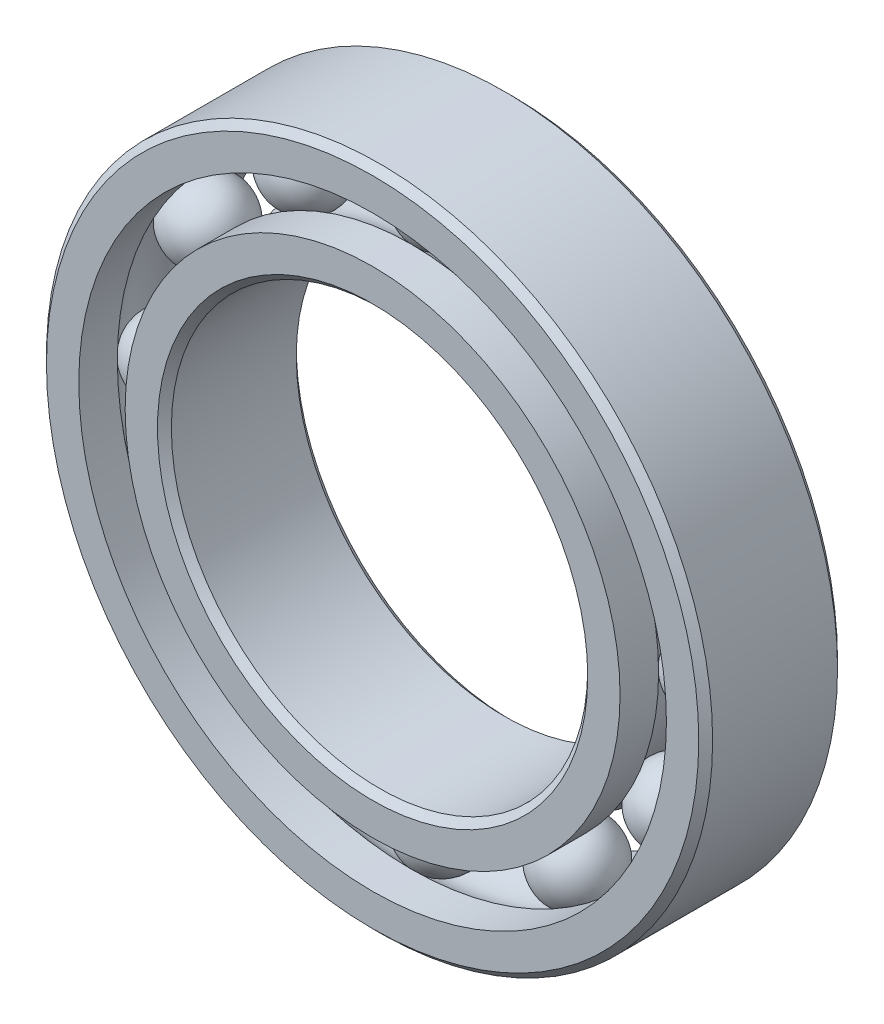
ISO-10303-21;
HEADER;
FILE_DESCRIPTION(('STEP AP214'),'2;1');
FILE_NAME('part.step','',(''),(''),'','','');
FILE_SCHEMA(('AUTOMOTIVE_DESIGN { 1 0 10303 214 1 1 1 1 }'));
ENDSEC;
DATA;
#1=APPLICATION_CONTEXT('core data for automotive mechanical design processes');
#2=APPLICATION_PROTOCOL_DEFINITION('international standard','automotive_design',2000,#1);
#3=PRODUCT_CONTEXT('',#1,'mechanical');
#4=PRODUCT('Part','Part','',(#3));
#5=PRODUCT_RELATED_PRODUCT_CATEGORY('part','',(#4));
#6=PRODUCT_DEFINITION_FORMATION('','',#4);
#7=PRODUCT_DEFINITION_CONTEXT('part definition',#1,'design');
#8=PRODUCT_DEFINITION('design','',#6,#7);
#9=PRODUCT_DEFINITION_SHAPE('','',#8);
#10=(LENGTH_UNIT() NAMED_UNIT(*) SI_UNIT(.MILLI.,.METRE.));
#11=(NAMED_UNIT(*) PLANE_ANGLE_UNIT() SI_UNIT($,.RADIAN.));
#12=(NAMED_UNIT(*) SI_UNIT($,.STERADIAN.) SOLID_ANGLE_UNIT());
#13=UNCERTAINTY_MEASURE_WITH_UNIT(LENGTH_MEASURE(1.E-05),#10,'distance_accuracy_value','');
#14=(GEOMETRIC_REPRESENTATION_CONTEXT(3) GLOBAL_UNCERTAINTY_ASSIGNED_CONTEXT((#13)) GLOBAL_UNIT_ASSIGNED_CONTEXT((#10,
#11,#12)) REPRESENTATION_CONTEXT('',''));
#15=CARTESIAN_POINT('',(0.,0.,0.));
#16=DIRECTION('',(0.,0.,1.));
#17=DIRECTION('',(1.,0.,0.));
#18=AXIS2_PLACEMENT_3D('',#15,#16,#17);
#19=CARTESIAN_POINT('',(-4.87499999999989,8.44374768689834,0.));
#20=DIRECTION('',(0.,0.,1.));
#21=DIRECTION('',(-0.499999999999989,0.866025403784445,0.));
#22=AXIS2_PLACEMENT_3D('',#19,#20,#21);
#23=SPHERICAL_SURFACE('',#22,1.38998856223009);
#24=CARTESIAN_POINT('',(-4.87499999999989,8.44374768689834,1.38998856223009));
#25=VERTEX_POINT('',#24);
#26=VERTEX_LOOP('',#25);
#27=FACE_BOUND('',#26,.T.);
#28=ADVANCED_FACE('F37',(#27),#23,.T.);
#29=CLOSED_SHELL('',(#28));
#30=MANIFOLD_SOLID_BREP('B2',#29);
#31=CARTESIAN_POINT('',(-8.44374768689822,4.8750000000001,0.));
#32=DIRECTION('',(0.,0.,1.));
#33=DIRECTION('',(-0.866025403784433,0.50000000000001,0.));
#34=AXIS2_PLACEMENT_3D('',#31,#32,#33);
#35=SPHERICAL_SURFACE('',#34,1.38998856223009);
#36=CARTESIAN_POINT('',(-8.44374768689822,4.8750000000001,1.38998856223009));
#37=VERTEX_POINT('',#36);
#38=VERTEX_LOOP('',#37);
#39=FACE_BOUND('',#38,.T.);
#40=ADVANCED_FACE('F57',(#39),#35,.T.);
#41=CLOSED_SHELL('',(#40));
#42=MANIFOLD_SOLID_BREP('B6',#41);
#43=CARTESIAN_POINT('',(-9.75,1.02125829161162E-13,0.));
#44=DIRECTION('',(0.,0.,1.));
#45=DIRECTION('',(-1.,0.,0.));
#46=AXIS2_PLACEMENT_3D('',#43,#44,#45);
#47=SPHERICAL_SURFACE('',#46,1.38998856223009);
#48=CARTESIAN_POINT('',(-9.75,1.02125829161162E-13,1.38998856223009));
#49=VERTEX_POINT('',#48);
#50=VERTEX_LOOP('',#49);
#51=FACE_BOUND('',#50,.T.);
#52=ADVANCED_FACE('F77',(#51),#47,.T.);
#53=CLOSED_SHELL('',(#52));
#54=MANIFOLD_SOLID_BREP('B33',#53);
#55=CARTESIAN_POINT('',(-8.44374768689832,-4.87499999999992,0.));
#56=DIRECTION('',(0.,0.,1.));
#57=DIRECTION('',(-0.866025403784443,-0.499999999999992,0.));
#58=AXIS2_PLACEMENT_3D('',#55,#56,#57);
#59=SPHERICAL_SURFACE('',#58,1.38998856223009);
#60=CARTESIAN_POINT('',(-8.44374768689832,-4.87499999999992,1.38998856223009));
#61=VERTEX_POINT('',#60);
#62=VERTEX_LOOP('',#61);
#63=FACE_BOUND('',#62,.T.);
#64=ADVANCED_FACE('F97',(#63),#59,.T.);
#65=CLOSED_SHELL('',(#64));
#66=MANIFOLD_SOLID_BREP('B53',#65);
#67=CARTESIAN_POINT('',(-4.87500000000007,-8.44374768689824,0.));
#68=DIRECTION('',(0.,0.,1.));
#69=DIRECTION('',(-0.500000000000007,-0.866025403784435,0.));
#70=AXIS2_PLACEMENT_3D('',#67,#68,#69);
#71=SPHERICAL_SURFACE('',#70,1.38998856223009);
#72=CARTESIAN_POINT('',(-4.87500000000007,-8.44374768689824,1.38998856223009));
#73=VERTEX_POINT('',#72);
#74=VERTEX_LOOP('',#73);
#75=FACE_BOUND('',#74,.T.);
#76=ADVANCED_FACE('F117',(#75),#71,.T.);
#77=CLOSED_SHELL('',(#76));
#78=MANIFOLD_SOLID_BREP('B73',#77);
#79=CARTESIAN_POINT('',(0.,-9.75,0.));
#80=DIRECTION('',(0.,0.,1.));
#81=DIRECTION('',(0.,-1.,0.));
#82=AXIS2_PLACEMENT_3D('',#79,#80,#81);
#83=SPHERICAL_SURFACE('',#82,1.38998856223009);
#84=CARTESIAN_POINT('',(0.,-9.75,1.38998856223009));
#85=VERTEX_POINT('',#84);
#86=VERTEX_LOOP('',#85);
#87=FACE_BOUND('',#86,.T.);
#88=ADVANCED_FACE('F137',(#87),#83,.T.);
#89=CLOSED_SHELL('',(#88));
#90=MANIFOLD_SOLID_BREP('B93',#89);
#91=CARTESIAN_POINT('',(4.87499999999995,-8.44374768689831,0.));
#92=DIRECTION('',(0.,0.,1.));
#93=DIRECTION('',(0.499999999999995,-0.866025403784442,0.));
#94=AXIS2_PLACEMENT_3D('',#91,#92,#93);
#95=SPHERICAL_SURFACE('',#94,1.38998856223009);
#96=CARTESIAN_POINT('',(4.87499999999995,-8.44374768689831,1.38998856223009));
#97=VERTEX_POINT('',#96);
#98=VERTEX_LOOP('',#97);
#99=FACE_BOUND('',#98,.T.);
#100=ADVANCED_FACE('F157',(#99),#95,.T.);
#101=CLOSED_SHELL('',(#100));
#102=MANIFOLD_SOLID_BREP('B113',#101);
#103=CARTESIAN_POINT('',(8.44374768689826,-4.87500000000004,0.));
#104=DIRECTION('',(0.,0.,1.));
#105=DIRECTION('',(0.866025403784436,-0.500000000000004,0.));
#106=AXIS2_PLACEMENT_3D('',#103,#104,#105);
#107=SPHERICAL_SURFACE('',#106,1.38998856223009);
#108=CARTESIAN_POINT('',(8.44374768689826,-4.87500000000004,1.38998856223009));
#109=VERTEX_POINT('',#108);
#110=VERTEX_LOOP('',#109);
#111=FACE_BOUND('',#110,.T.);
#112=ADVANCED_FACE('F177',(#111),#107,.T.);
#113=CLOSED_SHELL('',(#112));
#114=MANIFOLD_SOLID_BREP('B133',#113);
#115=CARTESIAN_POINT('',(9.75,0.,0.));
#116=DIRECTION('',(0.,0.,1.));
#117=DIRECTION('',(1.,0.,0.));
#118=AXIS2_PLACEMENT_3D('',#115,#116,#117);
#119=SPHERICAL_SURFACE('',#118,1.38998856223009);
#120=CARTESIAN_POINT('',(9.75,0.,1.38998856223009));
#121=VERTEX_POINT('',#120);
#122=VERTEX_LOOP('',#121);
#123=FACE_BOUND('',#122,.T.);
#124=ADVANCED_FACE('F197',(#123),#119,.T.);
#125=CLOSED_SHELL('',(#124));
#126=MANIFOLD_SOLID_BREP('B153',#125);
#127=CARTESIAN_POINT('',(8.44374768689829,4.87499999999998,0.));
#128=DIRECTION('',(0.,0.,1.));
#129=DIRECTION('',(0.86602540378444,0.499999999999998,0.));
#130=AXIS2_PLACEMENT_3D('',#127,#128,#129);
#131=SPHERICAL_SURFACE('',#130,1.38998856223009);
#132=CARTESIAN_POINT('',(8.44374768689829,4.87499999999998,1.38998856223009));
#133=VERTEX_POINT('',#132);
#134=VERTEX_LOOP('',#133);
#135=FACE_BOUND('',#134,.T.);
#136=ADVANCED_FACE('F217',(#135),#131,.T.);
#137=CLOSED_SHELL('',(#136));
#138=MANIFOLD_SOLID_BREP('B173',#137);
#139=CARTESIAN_POINT('',(4.87500000000001,8.44374768689827,0.));
#140=DIRECTION('',(0.,0.,1.));
#141=DIRECTION('',(0.500000000000001,0.866025403784438,0.));
#142=AXIS2_PLACEMENT_3D('',#139,#140,#141);
#143=SPHERICAL_SURFACE('',#142,1.38998856223009);
#144=CARTESIAN_POINT('',(4.87500000000001,8.44374768689827,1.38998856223009));
#145=VERTEX_POINT('',#144);
#146=VERTEX_LOOP('',#145);
#147=FACE_BOUND('',#146,.T.);
#148=ADVANCED_FACE('F237',(#147),#143,.T.);
#149=CLOSED_SHELL('',(#148));
#150=MANIFOLD_SOLID_BREP('B193',#149);
#151=CARTESIAN_POINT('',(0.,9.75,0.));
#152=DIRECTION('',(0.,0.,1.));
#153=DIRECTION('',(0.,1.,0.));
#154=AXIS2_PLACEMENT_3D('',#151,#152,#153);
#155=SPHERICAL_SURFACE('',#154,1.38998856223009);
#156=CARTESIAN_POINT('',(0.,9.75,1.38998856223009));
#157=VERTEX_POINT('',#156);
#158=VERTEX_LOOP('',#157);
#159=FACE_BOUND('',#158,.T.);
#160=ADVANCED_FACE('F259',(#159),#155,.T.);
#161=CLOSED_SHELL('',(#160));
#162=MANIFOLD_SOLID_BREP('B213',#161);
#163=CARTESIAN_POINT('',(0.,8.91483516483517,2.5));
#164=DIRECTION('',(0.,0.,-1.));
#165=DIRECTION('',(-1.,0.,0.));
#166=AXIS2_PLACEMENT_3D('',#163,#164,#165);
#167=PLANE('',#166);
#168=CARTESIAN_POINT('',(0.,0.,2.5));
#169=DIRECTION('',(0.,0.,1.));
#170=DIRECTION('',(1.,0.,0.));
#171=AXIS2_PLACEMENT_3D('',#168,#169,#170);
#172=CIRCLE('',#171,7.75);
#173=CARTESIAN_POINT('',(7.75,0.,2.5));
#174=VERTEX_POINT('',#173);
#175=EDGE_CURVE('E306',#174,#174,#172,.T.);
#176=ORIENTED_EDGE('',*,*,#175,.F.);
#177=EDGE_LOOP('',(#176));
#178=FACE_BOUND('',#177,.T.);
#179=CARTESIAN_POINT('',(0.,0.,2.5));
#180=DIRECTION('',(0.,0.,1.));
#181=DIRECTION('',(1.,0.,0.));
#182=AXIS2_PLACEMENT_3D('',#179,#180,#181);
#183=CIRCLE('',#182,8.91483516483517);
#184=CARTESIAN_POINT('',(8.91483516483517,0.,2.5));
#185=VERTEX_POINT('',#184);
#186=EDGE_CURVE('E258',#185,#185,#183,.T.);
#187=ORIENTED_EDGE('',*,*,#186,.T.);
#188=EDGE_LOOP('',(#187));
#189=FACE_BOUND('',#188,.T.);
#190=ADVANCED_FACE('F278',(#178,#189),#167,.F.);
#191=CARTESIAN_POINT('',(0.,0.,2.5));
#192=DIRECTION('',(0.,0.,1.));
#193=DIRECTION('',(1.,0.,0.));
#194=AXIS2_PLACEMENT_3D('',#191,#192,#193);
#195=CYLINDRICAL_SURFACE('',#194,8.91483516483517);
#196=ORIENTED_EDGE('',*,*,#186,.F.);
#197=EDGE_LOOP('',(#196));
#198=FACE_BOUND('',#197,.T.);
#199=CARTESIAN_POINT('',(0.,0.,1.11111111111111));
#200=DIRECTION('',(0.,0.,1.));
#201=DIRECTION('',(1.,0.,0.));
#202=AXIS2_PLACEMENT_3D('',#199,#200,#201);
#203=CIRCLE('',#202,8.91483516483517);
#204=CARTESIAN_POINT('',(8.91483516483517,0.,1.11111111111111));
#205=VERTEX_POINT('',#204);
#206=EDGE_CURVE('E284',#205,#205,#203,.T.);
#207=ORIENTED_EDGE('',*,*,#206,.T.);
#208=EDGE_LOOP('',(#207));
#209=FACE_BOUND('',#208,.T.);
#210=ADVANCED_FACE('F313',(#198,#209),#195,.T.);
#211=CARTESIAN_POINT('',(0.,0.,0.));
#212=DIRECTION('',(0.,0.,1.));
#213=DIRECTION('',(1.,0.,0.));
#214=AXIS2_PLACEMENT_3D('',#211,#212,#213);
#215=TOROIDAL_SURFACE('',#214,9.75,1.38998856223009);
#216=ORIENTED_EDGE('',*,*,#206,.F.);
#217=EDGE_LOOP('',(#216));
#218=FACE_BOUND('',#217,.T.);
#219=CARTESIAN_POINT('',(0.,0.,-1.11111111111111));
#220=DIRECTION('',(0.,0.,1.));
#221=DIRECTION('',(1.,0.,0.));
#222=AXIS2_PLACEMENT_3D('',#219,#220,#221);
#223=CIRCLE('',#222,8.91483516483516);
#224=CARTESIAN_POINT('',(8.91483516483516,0.,-1.11111111111111));
#225=VERTEX_POINT('',#224);
#226=EDGE_CURVE('E288',#225,#225,#223,.T.);
#227=ORIENTED_EDGE('',*,*,#226,.T.);
#228=EDGE_LOOP('',(#227));
#229=FACE_BOUND('',#228,.T.);
#230=ADVANCED_FACE('F317',(#218,#229),#215,.F.);
#231=CARTESIAN_POINT('',(0.,0.,2.5));
#232=DIRECTION('',(0.,0.,1.));
#233=DIRECTION('',(1.,0.,0.));
#234=AXIS2_PLACEMENT_3D('',#231,#232,#233);
#235=CYLINDRICAL_SURFACE('',#234,8.91483516483517);
#236=ORIENTED_EDGE('',*,*,#226,.F.);
#237=EDGE_LOOP('',(#236));
#238=FACE_BOUND('',#237,.T.);
#239=CARTESIAN_POINT('',(0.,0.,-2.5));
#240=DIRECTION('',(0.,0.,1.));
#241=DIRECTION('',(1.,0.,0.));
#242=AXIS2_PLACEMENT_3D('',#239,#240,#241);
#243=CIRCLE('',#242,8.91483516483517);
#244=CARTESIAN_POINT('',(8.91483516483517,0.,-2.5));
#245=VERTEX_POINT('',#244);
#246=EDGE_CURVE('E292',#245,#245,#243,.T.);
#247=ORIENTED_EDGE('',*,*,#246,.T.);
#248=EDGE_LOOP('',(#247));
#249=FACE_BOUND('',#248,.T.);
#250=ADVANCED_FACE('F322',(#238,#249),#235,.T.);
#251=CARTESIAN_POINT('',(0.,7.75,-2.5));
#252=DIRECTION('',(0.,0.,1.));
#253=DIRECTION('',(1.,0.,0.));
#254=AXIS2_PLACEMENT_3D('',#251,#252,#253);
#255=PLANE('',#254);
#256=ORIENTED_EDGE('',*,*,#246,.F.);
#257=EDGE_LOOP('',(#256));
#258=FACE_BOUND('',#257,.T.);
#259=CARTESIAN_POINT('',(0.,0.,-2.5));
#260=DIRECTION('',(0.,0.,1.));
#261=DIRECTION('',(1.,0.,0.));
#262=AXIS2_PLACEMENT_3D('',#259,#260,#261);
#263=CIRCLE('',#262,7.75);
#264=CARTESIAN_POINT('',(7.75,0.,-2.5));
#265=VERTEX_POINT('',#264);
#266=EDGE_CURVE('E297',#265,#265,#263,.T.);
#267=ORIENTED_EDGE('',*,*,#266,.T.);
#268=EDGE_LOOP('',(#267));
#269=FACE_BOUND('',#268,.T.);
#270=ADVANCED_FACE('F328',(#258,#269),#255,.F.);
#271=CARTESIAN_POINT('',(0.,0.,-2.25));
#272=DIRECTION('',(0.,0.,-1.));
#273=DIRECTION('',(-1.,0.,0.));
#274=AXIS2_PLACEMENT_3D('',#271,#272,#273);
#275=CONICAL_SURFACE('',#274,7.5,0.78539816339745);
#276=ORIENTED_EDGE('',*,*,#266,.F.);
#277=EDGE_LOOP('',(#276));
#278=FACE_BOUND('',#277,.T.);
#279=CARTESIAN_POINT('',(0.,0.,-2.25));
#280=DIRECTION('',(0.,0.,1.));
#281=DIRECTION('',(1.,0.,0.));
#282=AXIS2_PLACEMENT_3D('',#279,#280,#281);
#283=CIRCLE('',#282,7.5);
#284=CARTESIAN_POINT('',(7.5,0.,-2.25));
#285=VERTEX_POINT('',#284);
#286=EDGE_CURVE('E300',#285,#285,#283,.T.);
#287=ORIENTED_EDGE('',*,*,#286,.T.);
#288=EDGE_LOOP('',(#287));
#289=FACE_BOUND('',#288,.T.);
#290=ADVANCED_FACE('F332',(#278,#289),#275,.F.);
#291=CARTESIAN_POINT('',(0.,0.,2.5));
#292=DIRECTION('',(0.,0.,1.));
#293=DIRECTION('',(1.,0.,0.));
#294=AXIS2_PLACEMENT_3D('',#291,#292,#293);
#295=CYLINDRICAL_SURFACE('',#294,7.5);
#296=ORIENTED_EDGE('',*,*,#286,.F.);
#297=EDGE_LOOP('',(#296));
#298=FACE_BOUND('',#297,.T.);
#299=CARTESIAN_POINT('',(0.,0.,2.25));
#300=DIRECTION('',(0.,0.,1.));
#301=DIRECTION('',(1.,0.,0.));
#302=AXIS2_PLACEMENT_3D('',#299,#300,#301);
#303=CIRCLE('',#302,7.5);
#304=CARTESIAN_POINT('',(7.5,0.,2.25));
#305=VERTEX_POINT('',#304);
#306=EDGE_CURVE('E303',#305,#305,#303,.T.);
#307=ORIENTED_EDGE('',*,*,#306,.T.);
#308=EDGE_LOOP('',(#307));
#309=FACE_BOUND('',#308,.T.);
#310=ADVANCED_FACE('F336',(#298,#309),#295,.F.);
#311=CARTESIAN_POINT('',(0.,0.,2.5));
#312=DIRECTION('',(0.,0.,1.));
#313=DIRECTION('',(1.,0.,0.));
#314=AXIS2_PLACEMENT_3D('',#311,#312,#313);
#315=CONICAL_SURFACE('',#314,7.75,0.785398163397447);
#316=ORIENTED_EDGE('',*,*,#306,.F.);
#317=EDGE_LOOP('',(#316));
#318=FACE_BOUND('',#317,.T.);
#319=ORIENTED_EDGE('',*,*,#175,.T.);
#320=EDGE_LOOP('',(#319));
#321=FACE_BOUND('',#320,.T.);
#322=ADVANCED_FACE('F310',(#318,#321),#315,.F.);
#323=CLOSED_SHELL('',(#190,#210,#230,#250,#270,#290,#310,#322));
#324=MANIFOLD_SOLID_BREP('B233',#323);
#325=CARTESIAN_POINT('',(0.,0.,2.25));
#326=DIRECTION('',(0.,0.,-1.));
#327=DIRECTION('',(-1.,0.,0.));
#328=AXIS2_PLACEMENT_3D('',#325,#326,#327);
#329=CONICAL_SURFACE('',#328,12.,0.785398163397448);
#330=CARTESIAN_POINT('',(0.,0.,2.5));
#331=DIRECTION('',(0.,0.,1.));
#332=DIRECTION('',(1.,0.,0.));
#333=AXIS2_PLACEMENT_3D('',#330,#331,#332);
#334=CIRCLE('',#333,11.75);
#335=CARTESIAN_POINT('',(11.75,0.,2.5));
#336=VERTEX_POINT('',#335);
#337=EDGE_CURVE('E427',#336,#336,#334,.T.);
#338=ORIENTED_EDGE('',*,*,#337,.F.);
#339=EDGE_LOOP('',(#338));
#340=FACE_BOUND('',#339,.T.);
#341=CARTESIAN_POINT('',(0.,0.,2.25));
#342=DIRECTION('',(0.,0.,1.));
#343=DIRECTION('',(1.,0.,0.));
#344=AXIS2_PLACEMENT_3D('',#341,#342,#343);
#345=CIRCLE('',#344,12.);
#346=CARTESIAN_POINT('',(12.,0.,2.25));
#347=VERTEX_POINT('',#346);
#348=EDGE_CURVE('E277',#347,#347,#345,.T.);
#349=ORIENTED_EDGE('',*,*,#348,.T.);
#350=EDGE_LOOP('',(#349));
#351=FACE_BOUND('',#350,.T.);
#352=ADVANCED_FACE('F399',(#340,#351),#329,.T.);
#353=CARTESIAN_POINT('',(0.,0.,2.5));
#354=DIRECTION('',(0.,0.,1.));
#355=DIRECTION('',(1.,0.,0.));
#356=AXIS2_PLACEMENT_3D('',#353,#354,#355);
#357=CYLINDRICAL_SURFACE('',#356,12.);
#358=ORIENTED_EDGE('',*,*,#348,.F.);
#359=EDGE_LOOP('',(#358));
#360=FACE_BOUND('',#359,.T.);
#361=CARTESIAN_POINT('',(0.,0.,-2.25));
#362=DIRECTION('',(0.,0.,1.));
#363=DIRECTION('',(1.,0.,0.));
#364=AXIS2_PLACEMENT_3D('',#361,#362,#363);
#365=CIRCLE('',#364,12.);
#366=CARTESIAN_POINT('',(12.,0.,-2.25));
#367=VERTEX_POINT('',#366);
#368=EDGE_CURVE('E405',#367,#367,#365,.T.);
#369=ORIENTED_EDGE('',*,*,#368,.T.);
#370=EDGE_LOOP('',(#369));
#371=FACE_BOUND('',#370,.T.);
#372=ADVANCED_FACE('F434',(#360,#371),#357,.T.);
#373=CARTESIAN_POINT('',(0.,0.,-2.5));
#374=DIRECTION('',(0.,0.,1.));
#375=DIRECTION('',(1.,0.,0.));
#376=AXIS2_PLACEMENT_3D('',#373,#374,#375);
#377=CONICAL_SURFACE('',#376,11.75,0.785398163397448);
#378=ORIENTED_EDGE('',*,*,#368,.F.);
#379=EDGE_LOOP('',(#378));
#380=FACE_BOUND('',#379,.T.);
#381=CARTESIAN_POINT('',(0.,0.,-2.5));
#382=DIRECTION('',(0.,0.,1.));
#383=DIRECTION('',(1.,0.,0.));
#384=AXIS2_PLACEMENT_3D('',#381,#382,#383);
#385=CIRCLE('',#384,11.75);
#386=CARTESIAN_POINT('',(11.75,0.,-2.5));
#387=VERTEX_POINT('',#386);
#388=EDGE_CURVE('E409',#387,#387,#385,.T.);
#389=ORIENTED_EDGE('',*,*,#388,.T.);
#390=EDGE_LOOP('',(#389));
#391=FACE_BOUND('',#390,.T.);
#392=ADVANCED_FACE('F438',(#380,#391),#377,.T.);
#393=CARTESIAN_POINT('',(0.,11.75,-2.5));
#394=DIRECTION('',(0.,0.,1.));
#395=DIRECTION('',(1.,0.,0.));
#396=AXIS2_PLACEMENT_3D('',#393,#394,#395);
#397=PLANE('',#396);
#398=ORIENTED_EDGE('',*,*,#388,.F.);
#399=EDGE_LOOP('',(#398));
#400=FACE_BOUND('',#399,.T.);
#401=CARTESIAN_POINT('',(0.,0.,-2.5));
#402=DIRECTION('',(0.,0.,1.));
#403=DIRECTION('',(1.,0.,0.));
#404=AXIS2_PLACEMENT_3D('',#401,#402,#403);
#405=CIRCLE('',#404,10.5851648351648);
#406=CARTESIAN_POINT('',(10.5851648351648,0.,-2.5));
#407=VERTEX_POINT('',#406);
#408=EDGE_CURVE('E413',#407,#407,#405,.T.);
#409=ORIENTED_EDGE('',*,*,#408,.T.);
#410=EDGE_LOOP('',(#409));
#411=FACE_BOUND('',#410,.T.);
#412=ADVANCED_FACE('F443',(#400,#411),#397,.F.);
#413=CARTESIAN_POINT('',(0.,0.,2.5));
#414=DIRECTION('',(0.,0.,1.));
#415=DIRECTION('',(1.,0.,0.));
#416=AXIS2_PLACEMENT_3D('',#413,#414,#415);
#417=CYLINDRICAL_SURFACE('',#416,10.5851648351648);
#418=ORIENTED_EDGE('',*,*,#408,.F.);
#419=EDGE_LOOP('',(#418));
#420=FACE_BOUND('',#419,.T.);
#421=CARTESIAN_POINT('',(0.,0.,-1.11111111111111));
#422=DIRECTION('',(0.,0.,1.));
#423=DIRECTION('',(1.,0.,0.));
#424=AXIS2_PLACEMENT_3D('',#421,#422,#423);
#425=CIRCLE('',#424,10.5851648351648);
#426=CARTESIAN_POINT('',(10.5851648351648,0.,-1.11111111111111));
#427=VERTEX_POINT('',#426);
#428=EDGE_CURVE('E418',#427,#427,#425,.T.);
#429=ORIENTED_EDGE('',*,*,#428,.T.);
#430=EDGE_LOOP('',(#429));
#431=FACE_BOUND('',#430,.T.);
#432=ADVANCED_FACE('F449',(#420,#431),#417,.F.);
#433=CARTESIAN_POINT('',(0.,0.,0.));
#434=DIRECTION('',(0.,0.,1.));
#435=DIRECTION('',(1.,0.,0.));
#436=AXIS2_PLACEMENT_3D('',#433,#434,#435);
#437=TOROIDAL_SURFACE('',#436,9.75,1.38998856223009);
#438=ORIENTED_EDGE('',*,*,#428,.F.);
#439=EDGE_LOOP('',(#438));
#440=FACE_BOUND('',#439,.T.);
#441=CARTESIAN_POINT('',(0.,0.,1.11111111111111));
#442=DIRECTION('',(0.,0.,1.));
#443=DIRECTION('',(1.,0.,0.));
#444=AXIS2_PLACEMENT_3D('',#441,#442,#443);
#445=CIRCLE('',#444,10.5851648351648);
#446=CARTESIAN_POINT('',(10.5851648351648,0.,1.11111111111111));
#447=VERTEX_POINT('',#446);
#448=EDGE_CURVE('E421',#447,#447,#445,.T.);
#449=ORIENTED_EDGE('',*,*,#448,.T.);
#450=EDGE_LOOP('',(#449));
#451=FACE_BOUND('',#450,.T.);
#452=ADVANCED_FACE('F453',(#440,#451),#437,.F.);
#453=CARTESIAN_POINT('',(0.,0.,2.5));
#454=DIRECTION('',(0.,0.,1.));
#455=DIRECTION('',(1.,0.,0.));
#456=AXIS2_PLACEMENT_3D('',#453,#454,#455);
#457=CYLINDRICAL_SURFACE('',#456,10.5851648351648);
#458=ORIENTED_EDGE('',*,*,#448,.F.);
#459=EDGE_LOOP('',(#458));
#460=FACE_BOUND('',#459,.T.);
#461=CARTESIAN_POINT('',(0.,0.,2.5));
#462=DIRECTION('',(0.,0.,1.));
#463=DIRECTION('',(1.,0.,0.));
#464=AXIS2_PLACEMENT_3D('',#461,#462,#463);
#465=CIRCLE('',#464,10.5851648351648);
#466=CARTESIAN_POINT('',(10.5851648351648,0.,2.5));
#467=VERTEX_POINT('',#466);
#468=EDGE_CURVE('E424',#467,#467,#465,.T.);
#469=ORIENTED_EDGE('',*,*,#468,.T.);
#470=EDGE_LOOP('',(#469));
#471=FACE_BOUND('',#470,.T.);
#472=ADVANCED_FACE('F457',(#460,#471),#457,.F.);
#473=CARTESIAN_POINT('',(0.,11.75,2.5));
#474=DIRECTION('',(0.,0.,-1.));
#475=DIRECTION('',(-1.,0.,0.));
#476=AXIS2_PLACEMENT_3D('',#473,#474,#475);
#477=PLANE('',#476);
#478=ORIENTED_EDGE('',*,*,#468,.F.);
#479=EDGE_LOOP('',(#478));
#480=FACE_BOUND('',#479,.T.);
#481=ORIENTED_EDGE('',*,*,#337,.T.);
#482=EDGE_LOOP('',(#481));
#483=FACE_BOUND('',#482,.T.);
#484=ADVANCED_FACE('F431',(#480,#483),#477,.F.);
#485=CLOSED_SHELL('',(#352,#372,#392,#412,#432,#452,#472,#484));
#486=MANIFOLD_SOLID_BREP('B253',#485);
#487=ADVANCED_BREP_SHAPE_REPRESENTATION('',(#18,#30,#42,#54,#66,#78,#90,#102,#114,#126,#138,
#150,#162,#324,#486),#14);
#488=SHAPE_DEFINITION_REPRESENTATION(#9,#487);
ENDSEC;
END-ISO-10303-21;
